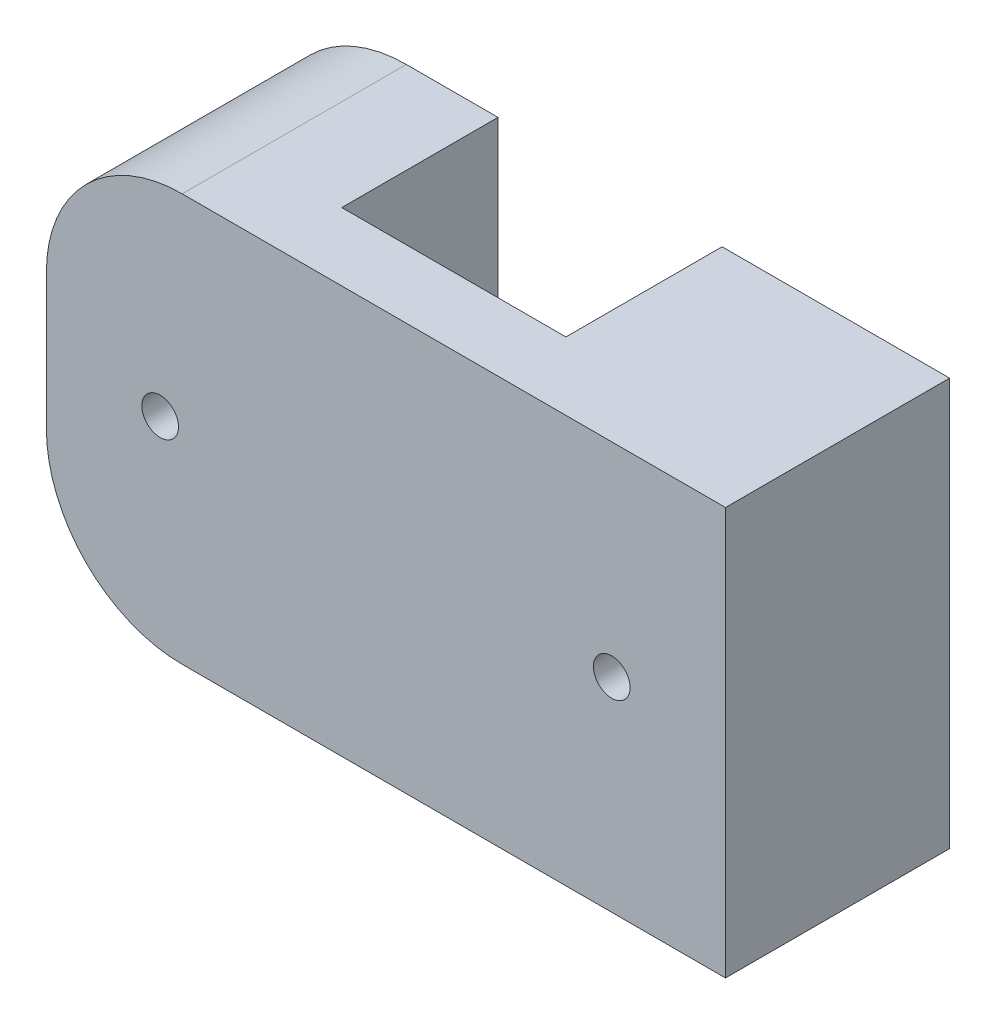
ISO-10303-21;
HEADER;
FILE_DESCRIPTION(('STEP AP214'),'2;1');
FILE_NAME('part.step','',(''),(''),'','','');
FILE_SCHEMA(('AUTOMOTIVE_DESIGN { 1 0 10303 214 1 1 1 1 }'));
ENDSEC;
DATA;
#1=APPLICATION_CONTEXT('core data for automotive mechanical design processes');
#2=APPLICATION_PROTOCOL_DEFINITION('international standard','automotive_design',2000,#1);
#3=PRODUCT_CONTEXT('',#1,'mechanical');
#4=PRODUCT('Part','Part','',(#3));
#5=PRODUCT_RELATED_PRODUCT_CATEGORY('part','',(#4));
#6=PRODUCT_DEFINITION_FORMATION('','',#4);
#7=PRODUCT_DEFINITION_CONTEXT('part definition',#1,'design');
#8=PRODUCT_DEFINITION('design','',#6,#7);
#9=PRODUCT_DEFINITION_SHAPE('','',#8);
#10=(LENGTH_UNIT() NAMED_UNIT(*) SI_UNIT(.MILLI.,.METRE.));
#11=(NAMED_UNIT(*) PLANE_ANGLE_UNIT() SI_UNIT($,.RADIAN.));
#12=(NAMED_UNIT(*) SI_UNIT($,.STERADIAN.) SOLID_ANGLE_UNIT());
#13=UNCERTAINTY_MEASURE_WITH_UNIT(LENGTH_MEASURE(1.E-05),#10,'distance_accuracy_value','');
#14=(GEOMETRIC_REPRESENTATION_CONTEXT(3) GLOBAL_UNCERTAINTY_ASSIGNED_CONTEXT((#13)) GLOBAL_UNIT_ASSIGNED_CONTEXT((#10,
#11,#12)) REPRESENTATION_CONTEXT('',''));
#15=CARTESIAN_POINT('',(0.,0.,0.));
#16=DIRECTION('',(0.,0.,1.));
#17=DIRECTION('',(1.,0.,0.));
#18=AXIS2_PLACEMENT_3D('',#15,#16,#17);
#19=CARTESIAN_POINT('',(16.75,0.,29.9));
#20=DIRECTION('',(1.,0.,0.));
#21=DIRECTION('',(0.,0.,-1.));
#22=AXIS2_PLACEMENT_3D('',#19,#20,#21);
#23=PLANE('',#22);
#24=DIRECTION('',(0.,-1.,0.));
#25=VECTOR('',#24,1.);
#26=CARTESIAN_POINT('',(16.75,0.,18.4));
#27=LINE('',#26,#25);
#28=CARTESIAN_POINT('',(16.75,30.,18.4));
#29=VERTEX_POINT('',#28);
#30=CARTESIAN_POINT('',(16.75,0.,18.4));
#31=VERTEX_POINT('',#30);
#32=EDGE_CURVE('E164',#29,#31,#27,.T.);
#33=ORIENTED_EDGE('',*,*,#32,.F.);
#34=DIRECTION('',(0.,0.,-1.));
#35=VECTOR('',#34,1.);
#36=CARTESIAN_POINT('',(16.75,30.,29.9));
#37=LINE('',#36,#35);
#38=CARTESIAN_POINT('',(16.75,30.,29.9));
#39=VERTEX_POINT('',#38);
#40=EDGE_CURVE('E174',#39,#29,#37,.T.);
#41=ORIENTED_EDGE('',*,*,#40,.F.);
#42=DIRECTION('',(0.,-1.,0.));
#43=VECTOR('',#42,1.);
#44=CARTESIAN_POINT('',(16.75,0.,29.9));
#45=LINE('',#44,#43);
#46=CARTESIAN_POINT('',(16.75,0.,29.9));
#47=VERTEX_POINT('',#46);
#48=EDGE_CURVE('E159',#39,#47,#45,.T.);
#49=ORIENTED_EDGE('',*,*,#48,.T.);
#50=DIRECTION('',(0.,0.,-1.));
#51=VECTOR('',#50,1.);
#52=CARTESIAN_POINT('',(16.75,0.,29.9));
#53=LINE('',#52,#51);
#54=EDGE_CURVE('E142',#47,#31,#53,.T.);
#55=ORIENTED_EDGE('',*,*,#54,.T.);
#56=EDGE_LOOP('',(#33,#41,#49,#55));
#57=FACE_BOUND('',#56,.T.);
#58=ADVANCED_FACE('F38',(#57),#23,.T.);
#59=CARTESIAN_POINT('',(0.,30.,29.9));
#60=DIRECTION('',(0.,-1.,0.));
#61=DIRECTION('',(0.,0.,-1.));
#62=AXIS2_PLACEMENT_3D('',#59,#60,#61);
#63=PLANE('',#62);
#64=DIRECTION('',(-1.,0.,0.));
#65=VECTOR('',#64,1.);
#66=CARTESIAN_POINT('',(0.,30.,18.4));
#67=LINE('',#66,#65);
#68=CARTESIAN_POINT('',(10.,30.,18.4));
#69=VERTEX_POINT('',#68);
#70=EDGE_CURVE('E167',#29,#69,#67,.T.);
#71=ORIENTED_EDGE('',*,*,#70,.T.);
#72=DIRECTION('',(0.,0.,-1.));
#73=VECTOR('',#72,1.);
#74=CARTESIAN_POINT('',(10.,30.,29.9));
#75=LINE('',#74,#73);
#76=CARTESIAN_POINT('',(10.,30.,34.9));
#77=VERTEX_POINT('',#76);
#78=EDGE_CURVE('E61',#69,#77,#75,.F.);
#79=ORIENTED_EDGE('',*,*,#78,.T.);
#80=DIRECTION('',(-1.,0.,0.));
#81=VECTOR('',#80,1.);
#82=CARTESIAN_POINT('',(0.,30.,34.9));
#83=LINE('',#82,#81);
#84=CARTESIAN_POINT('',(50.,30.,34.9));
#85=VERTEX_POINT('',#84);
#86=EDGE_CURVE('E151',#85,#77,#83,.T.);
#87=ORIENTED_EDGE('',*,*,#86,.F.);
#88=DIRECTION('',(0.,0.,-1.));
#89=VECTOR('',#88,1.);
#90=CARTESIAN_POINT('',(50.,30.,34.9));
#91=LINE('',#90,#89);
#92=CARTESIAN_POINT('',(50.,30.,18.4));
#93=VERTEX_POINT('',#92);
#94=EDGE_CURVE('E154',#85,#93,#91,.T.);
#95=ORIENTED_EDGE('',*,*,#94,.T.);
#96=DIRECTION('',(-1.,0.,0.));
#97=VECTOR('',#96,1.);
#98=CARTESIAN_POINT('',(0.,30.,18.4));
#99=LINE('',#98,#97);
#100=CARTESIAN_POINT('',(33.25,30.,18.4));
#101=VERTEX_POINT('',#100);
#102=EDGE_CURVE('E138',#93,#101,#99,.T.);
#103=ORIENTED_EDGE('',*,*,#102,.T.);
#104=DIRECTION('',(0.,0.,-1.));
#105=VECTOR('',#104,1.);
#106=CARTESIAN_POINT('',(33.25,30.,29.9));
#107=LINE('',#106,#105);
#108=CARTESIAN_POINT('',(33.25,30.,29.9));
#109=VERTEX_POINT('',#108);
#110=EDGE_CURVE('E130',#109,#101,#107,.T.);
#111=ORIENTED_EDGE('',*,*,#110,.F.);
#112=DIRECTION('',(-1.,0.,0.));
#113=VECTOR('',#112,1.);
#114=CARTESIAN_POINT('',(0.,30.,29.9));
#115=LINE('',#114,#113);
#116=EDGE_CURVE('E137',#109,#39,#115,.T.);
#117=ORIENTED_EDGE('',*,*,#116,.T.);
#118=ORIENTED_EDGE('',*,*,#40,.T.);
#119=EDGE_LOOP('',(#71,#79,#87,#95,#103,#111,#117,#118));
#120=FACE_BOUND('',#119,.T.);
#121=ADVANCED_FACE('F203',(#120),#63,.F.);
#122=CARTESIAN_POINT('',(0.,0.,29.9));
#123=DIRECTION('',(1.,0.,0.));
#124=DIRECTION('',(0.,0.,-1.));
#125=AXIS2_PLACEMENT_3D('',#122,#123,#124);
#126=PLANE('',#125);
#127=DIRECTION('',(0.,-1.,0.));
#128=VECTOR('',#127,1.);
#129=CARTESIAN_POINT('',(0.,0.,34.9));
#130=LINE('',#129,#128);
#131=CARTESIAN_POINT('',(0.,20.,34.9));
#132=VERTEX_POINT('',#131);
#133=CARTESIAN_POINT('',(0.,10.,34.9));
#134=VERTEX_POINT('',#133);
#135=EDGE_CURVE('E146',#132,#134,#130,.T.);
#136=ORIENTED_EDGE('',*,*,#135,.F.);
#137=DIRECTION('',(0.,0.,-1.));
#138=VECTOR('',#137,1.);
#139=CARTESIAN_POINT('',(0.,20.,29.9));
#140=LINE('',#139,#138);
#141=CARTESIAN_POINT('',(0.,20.,18.4));
#142=VERTEX_POINT('',#141);
#143=EDGE_CURVE('E178',#132,#142,#140,.T.);
#144=ORIENTED_EDGE('',*,*,#143,.T.);
#145=DIRECTION('',(0.,-1.,0.));
#146=VECTOR('',#145,1.);
#147=CARTESIAN_POINT('',(0.,0.,18.4));
#148=LINE('',#147,#146);
#149=CARTESIAN_POINT('',(0.,10.,18.4));
#150=VERTEX_POINT('',#149);
#151=EDGE_CURVE('E169',#142,#150,#148,.T.);
#152=ORIENTED_EDGE('',*,*,#151,.T.);
#153=DIRECTION('',(0.,0.,-1.));
#154=VECTOR('',#153,1.);
#155=CARTESIAN_POINT('',(0.,10.,29.9));
#156=LINE('',#155,#154);
#157=EDGE_CURVE('E176',#150,#134,#156,.F.);
#158=ORIENTED_EDGE('',*,*,#157,.T.);
#159=EDGE_LOOP('',(#136,#144,#152,#158));
#160=FACE_BOUND('',#159,.T.);
#161=ADVANCED_FACE('F193',(#160),#126,.F.);
#162=CARTESIAN_POINT('',(8.375,15.,29.9));
#163=DIRECTION('',(0.,0.,-1.));
#164=DIRECTION('',(-1.,0.,0.));
#165=AXIS2_PLACEMENT_3D('',#162,#163,#164);
#166=CYLINDRICAL_SURFACE('',#165,1.35);
#167=CARTESIAN_POINT('',(8.375,15.,18.4));
#168=DIRECTION('',(0.,0.,1.));
#169=DIRECTION('',(1.,0.,0.));
#170=AXIS2_PLACEMENT_3D('',#167,#168,#169);
#171=CIRCLE('',#170,1.35);
#172=CARTESIAN_POINT('',(9.725,15.,18.4));
#173=VERTEX_POINT('',#172);
#174=EDGE_CURVE('E158',#173,#173,#171,.T.);
#175=ORIENTED_EDGE('',*,*,#174,.F.);
#176=EDGE_LOOP('',(#175));
#177=FACE_BOUND('',#176,.T.);
#178=CARTESIAN_POINT('',(8.375,15.,34.9));
#179=DIRECTION('',(0.,0.,1.));
#180=DIRECTION('',(1.,0.,0.));
#181=AXIS2_PLACEMENT_3D('',#178,#179,#180);
#182=CIRCLE('',#181,1.35);
#183=CARTESIAN_POINT('',(9.725,15.,34.9));
#184=VERTEX_POINT('',#183);
#185=EDGE_CURVE('E144',#184,#184,#182,.T.);
#186=ORIENTED_EDGE('',*,*,#185,.T.);
#187=EDGE_LOOP('',(#186));
#188=FACE_BOUND('',#187,.T.);
#189=ADVANCED_FACE('F223',(#177,#188),#166,.F.);
#190=CARTESIAN_POINT('',(0.,0.,29.9));
#191=DIRECTION('',(0.,1.,0.));
#192=DIRECTION('',(0.,0.,1.));
#193=AXIS2_PLACEMENT_3D('',#190,#191,#192);
#194=PLANE('',#193);
#195=DIRECTION('',(1.,0.,0.));
#196=VECTOR('',#195,1.);
#197=CARTESIAN_POINT('',(0.,0.,34.9));
#198=LINE('',#197,#196);
#199=CARTESIAN_POINT('',(10.,0.,34.9));
#200=VERTEX_POINT('',#199);
#201=CARTESIAN_POINT('',(50.,0.,34.9));
#202=VERTEX_POINT('',#201);
#203=EDGE_CURVE('E196',#200,#202,#198,.T.);
#204=ORIENTED_EDGE('',*,*,#203,.F.);
#205=DIRECTION('',(0.,0.,-1.));
#206=VECTOR('',#205,1.);
#207=CARTESIAN_POINT('',(10.,0.,29.9));
#208=LINE('',#207,#206);
#209=CARTESIAN_POINT('',(10.,0.,18.4));
#210=VERTEX_POINT('',#209);
#211=EDGE_CURVE('E11',#200,#210,#208,.T.);
#212=ORIENTED_EDGE('',*,*,#211,.T.);
#213=DIRECTION('',(1.,0.,0.));
#214=VECTOR('',#213,1.);
#215=CARTESIAN_POINT('',(0.,0.,18.4));
#216=LINE('',#215,#214);
#217=EDGE_CURVE('E161',#210,#31,#216,.T.);
#218=ORIENTED_EDGE('',*,*,#217,.T.);
#219=ORIENTED_EDGE('',*,*,#54,.F.);
#220=DIRECTION('',(1.,0.,0.));
#221=VECTOR('',#220,1.);
#222=CARTESIAN_POINT('',(0.,0.,29.9));
#223=LINE('',#222,#221);
#224=CARTESIAN_POINT('',(33.25,0.,29.9));
#225=VERTEX_POINT('',#224);
#226=EDGE_CURVE('E135',#47,#225,#223,.T.);
#227=ORIENTED_EDGE('',*,*,#226,.T.);
#228=DIRECTION('',(0.,0.,-1.));
#229=VECTOR('',#228,1.);
#230=CARTESIAN_POINT('',(33.25,0.,29.9));
#231=LINE('',#230,#229);
#232=CARTESIAN_POINT('',(33.25,0.,18.4));
#233=VERTEX_POINT('',#232);
#234=EDGE_CURVE('E118',#225,#233,#231,.T.);
#235=ORIENTED_EDGE('',*,*,#234,.T.);
#236=DIRECTION('',(1.,0.,0.));
#237=VECTOR('',#236,1.);
#238=CARTESIAN_POINT('',(0.,0.,18.4));
#239=LINE('',#238,#237);
#240=CARTESIAN_POINT('',(50.,0.,18.4));
#241=VERTEX_POINT('',#240);
#242=EDGE_CURVE('E255',#233,#241,#239,.T.);
#243=ORIENTED_EDGE('',*,*,#242,.T.);
#244=DIRECTION('',(0.,0.,-1.));
#245=VECTOR('',#244,1.);
#246=CARTESIAN_POINT('',(50.,0.,34.9));
#247=LINE('',#246,#245);
#248=EDGE_CURVE('E156',#202,#241,#247,.T.);
#249=ORIENTED_EDGE('',*,*,#248,.F.);
#250=EDGE_LOOP('',(#204,#212,#218,#219,#227,#235,#243,#249));
#251=FACE_BOUND('',#250,.T.);
#252=ADVANCED_FACE('F140',(#251),#194,.F.);
#253=CARTESIAN_POINT('',(0.,0.,18.4));
#254=DIRECTION('',(0.,0.,1.));
#255=DIRECTION('',(1.,0.,0.));
#256=AXIS2_PLACEMENT_3D('',#253,#254,#255);
#257=PLANE('',#256);
#258=ORIENTED_EDGE('',*,*,#174,.T.);
#259=EDGE_LOOP('',(#258));
#260=FACE_BOUND('',#259,.T.);
#261=ORIENTED_EDGE('',*,*,#151,.F.);
#262=CARTESIAN_POINT('',(10.,20.,18.4));
#263=DIRECTION('',(0.,0.,1.));
#264=DIRECTION('',(1.,0.,0.));
#265=AXIS2_PLACEMENT_3D('',#262,#263,#264);
#266=CIRCLE('',#265,10.);
#267=EDGE_CURVE('E183',#142,#69,#266,.F.);
#268=ORIENTED_EDGE('',*,*,#267,.T.);
#269=ORIENTED_EDGE('',*,*,#70,.F.);
#270=ORIENTED_EDGE('',*,*,#32,.T.);
#271=ORIENTED_EDGE('',*,*,#217,.F.);
#272=CARTESIAN_POINT('',(10.,10.,18.4));
#273=DIRECTION('',(0.,0.,1.));
#274=DIRECTION('',(1.,0.,0.));
#275=AXIS2_PLACEMENT_3D('',#272,#273,#274);
#276=CIRCLE('',#275,10.);
#277=EDGE_CURVE('E181',#210,#150,#276,.F.);
#278=ORIENTED_EDGE('',*,*,#277,.T.);
#279=EDGE_LOOP('',(#261,#268,#269,#270,#271,#278));
#280=FACE_BOUND('',#279,.T.);
#281=ADVANCED_FACE('F201',(#260,#280),#257,.F.);
#282=CARTESIAN_POINT('',(0.,0.,29.9));
#283=DIRECTION('',(0.,0.,-1.));
#284=DIRECTION('',(-1.,0.,0.));
#285=AXIS2_PLACEMENT_3D('',#282,#283,#284);
#286=PLANE('',#285);
#287=DIRECTION('',(0.,1.,0.));
#288=VECTOR('',#287,1.);
#289=CARTESIAN_POINT('',(33.25,0.,29.9));
#290=LINE('',#289,#288);
#291=EDGE_CURVE('E121',#225,#109,#290,.T.);
#292=ORIENTED_EDGE('',*,*,#291,.F.);
#293=ORIENTED_EDGE('',*,*,#226,.F.);
#294=ORIENTED_EDGE('',*,*,#48,.F.);
#295=ORIENTED_EDGE('',*,*,#116,.F.);
#296=EDGE_LOOP('',(#292,#293,#294,#295));
#297=FACE_BOUND('',#296,.T.);
#298=ADVANCED_FACE('F133',(#297),#286,.T.);
#299=CARTESIAN_POINT('',(0.,0.,34.9));
#300=DIRECTION('',(0.,0.,-1.));
#301=DIRECTION('',(-1.,0.,0.));
#302=AXIS2_PLACEMENT_3D('',#299,#300,#301);
#303=PLANE('',#302);
#304=ORIENTED_EDGE('',*,*,#86,.T.);
#305=CARTESIAN_POINT('',(10.,20.,34.9));
#306=DIRECTION('',(0.,0.,-1.));
#307=DIRECTION('',(-1.,0.,0.));
#308=AXIS2_PLACEMENT_3D('',#305,#306,#307);
#309=CIRCLE('',#308,10.);
#310=EDGE_CURVE('E46',#77,#132,#309,.F.);
#311=ORIENTED_EDGE('',*,*,#310,.T.);
#312=ORIENTED_EDGE('',*,*,#135,.T.);
#313=CARTESIAN_POINT('',(10.,10.,34.9));
#314=DIRECTION('',(0.,0.,-1.));
#315=DIRECTION('',(-1.,0.,0.));
#316=AXIS2_PLACEMENT_3D('',#313,#314,#315);
#317=CIRCLE('',#316,10.);
#318=EDGE_CURVE('E53',#134,#200,#317,.F.);
#319=ORIENTED_EDGE('',*,*,#318,.T.);
#320=ORIENTED_EDGE('',*,*,#203,.T.);
#321=DIRECTION('',(0.,1.,0.));
#322=VECTOR('',#321,1.);
#323=CARTESIAN_POINT('',(50.,0.,34.9));
#324=LINE('',#323,#322);
#325=EDGE_CURVE('E244',#202,#85,#324,.T.);
#326=ORIENTED_EDGE('',*,*,#325,.T.);
#327=EDGE_LOOP('',(#304,#311,#312,#319,#320,#326));
#328=FACE_BOUND('',#327,.T.);
#329=ORIENTED_EDGE('',*,*,#185,.F.);
#330=EDGE_LOOP('',(#329));
#331=FACE_BOUND('',#330,.T.);
#332=CARTESIAN_POINT('',(41.625,15.,34.9));
#333=DIRECTION('',(0.,0.,1.));
#334=DIRECTION('',(1.,0.,0.));
#335=AXIS2_PLACEMENT_3D('',#332,#333,#334);
#336=CIRCLE('',#335,1.35);
#337=CARTESIAN_POINT('',(42.975,15.,34.9));
#338=VERTEX_POINT('',#337);
#339=EDGE_CURVE('E129',#338,#338,#336,.T.);
#340=ORIENTED_EDGE('',*,*,#339,.F.);
#341=EDGE_LOOP('',(#340));
#342=FACE_BOUND('',#341,.T.);
#343=ADVANCED_FACE('F188',(#328,#331,#342),#303,.F.);
#344=CARTESIAN_POINT('',(50.,0.,34.9));
#345=DIRECTION('',(-1.,0.,0.));
#346=DIRECTION('',(0.,0.,1.));
#347=AXIS2_PLACEMENT_3D('',#344,#345,#346);
#348=PLANE('',#347);
#349=ORIENTED_EDGE('',*,*,#248,.T.);
#350=DIRECTION('',(0.,1.,0.));
#351=VECTOR('',#350,1.);
#352=CARTESIAN_POINT('',(50.,0.,18.4));
#353=LINE('',#352,#351);
#354=EDGE_CURVE('E250',#241,#93,#353,.T.);
#355=ORIENTED_EDGE('',*,*,#354,.T.);
#356=ORIENTED_EDGE('',*,*,#94,.F.);
#357=ORIENTED_EDGE('',*,*,#325,.F.);
#358=EDGE_LOOP('',(#349,#355,#356,#357));
#359=FACE_BOUND('',#358,.T.);
#360=ADVANCED_FACE('F236',(#359),#348,.F.);
#361=CARTESIAN_POINT('',(41.625,15.,34.9));
#362=DIRECTION('',(0.,0.,-1.));
#363=DIRECTION('',(-1.,0.,0.));
#364=AXIS2_PLACEMENT_3D('',#361,#362,#363);
#365=CYLINDRICAL_SURFACE('',#364,1.35);
#366=ORIENTED_EDGE('',*,*,#339,.T.);
#367=EDGE_LOOP('',(#366));
#368=FACE_BOUND('',#367,.T.);
#369=CARTESIAN_POINT('',(41.625,15.,18.4));
#370=DIRECTION('',(0.,0.,1.));
#371=DIRECTION('',(1.,0.,0.));
#372=AXIS2_PLACEMENT_3D('',#369,#370,#371);
#373=CIRCLE('',#372,1.35);
#374=CARTESIAN_POINT('',(42.975,15.,18.4));
#375=VERTEX_POINT('',#374);
#376=EDGE_CURVE('E260',#375,#375,#373,.T.);
#377=ORIENTED_EDGE('',*,*,#376,.F.);
#378=EDGE_LOOP('',(#377));
#379=FACE_BOUND('',#378,.T.);
#380=ADVANCED_FACE('F265',(#368,#379),#365,.F.);
#381=CARTESIAN_POINT('',(33.25,0.,29.9));
#382=DIRECTION('',(-1.,0.,0.));
#383=DIRECTION('',(0.,0.,1.));
#384=AXIS2_PLACEMENT_3D('',#381,#382,#383);
#385=PLANE('',#384);
#386=DIRECTION('',(0.,1.,0.));
#387=VECTOR('',#386,1.);
#388=CARTESIAN_POINT('',(33.25,0.,18.4));
#389=LINE('',#388,#387);
#390=EDGE_CURVE('E124',#233,#101,#389,.T.);
#391=ORIENTED_EDGE('',*,*,#390,.F.);
#392=ORIENTED_EDGE('',*,*,#234,.F.);
#393=ORIENTED_EDGE('',*,*,#291,.T.);
#394=ORIENTED_EDGE('',*,*,#110,.T.);
#395=EDGE_LOOP('',(#391,#392,#393,#394));
#396=FACE_BOUND('',#395,.T.);
#397=ADVANCED_FACE('F120',(#396),#385,.T.);
#398=CARTESIAN_POINT('',(0.,0.,18.4));
#399=DIRECTION('',(0.,0.,1.));
#400=DIRECTION('',(1.,0.,0.));
#401=AXIS2_PLACEMENT_3D('',#398,#399,#400);
#402=PLANE('',#401);
#403=ORIENTED_EDGE('',*,*,#376,.T.);
#404=EDGE_LOOP('',(#403));
#405=FACE_BOUND('',#404,.T.);
#406=ORIENTED_EDGE('',*,*,#390,.T.);
#407=ORIENTED_EDGE('',*,*,#102,.F.);
#408=ORIENTED_EDGE('',*,*,#354,.F.);
#409=ORIENTED_EDGE('',*,*,#242,.F.);
#410=EDGE_LOOP('',(#406,#407,#408,#409));
#411=FACE_BOUND('',#410,.T.);
#412=ADVANCED_FACE('F214',(#405,#411),#402,.F.);
#413=CARTESIAN_POINT('',(10.,20.,29.9));
#414=DIRECTION('',(0.,0.,-1.));
#415=DIRECTION('',(-1.,0.,0.));
#416=AXIS2_PLACEMENT_3D('',#413,#414,#415);
#417=CYLINDRICAL_SURFACE('',#416,10.);
#418=ORIENTED_EDGE('',*,*,#310,.F.);
#419=ORIENTED_EDGE('',*,*,#78,.F.);
#420=ORIENTED_EDGE('',*,*,#267,.F.);
#421=ORIENTED_EDGE('',*,*,#143,.F.);
#422=EDGE_LOOP('',(#418,#419,#420,#421));
#423=FACE_BOUND('',#422,.T.);
#424=ADVANCED_FACE('F198',(#423),#417,.T.);
#425=CARTESIAN_POINT('',(10.,10.,29.9));
#426=DIRECTION('',(0.,0.,-1.));
#427=DIRECTION('',(-1.,0.,0.));
#428=AXIS2_PLACEMENT_3D('',#425,#426,#427);
#429=CYLINDRICAL_SURFACE('',#428,10.);
#430=ORIENTED_EDGE('',*,*,#318,.F.);
#431=ORIENTED_EDGE('',*,*,#157,.F.);
#432=ORIENTED_EDGE('',*,*,#277,.F.);
#433=ORIENTED_EDGE('',*,*,#211,.F.);
#434=EDGE_LOOP('',(#430,#431,#432,#433));
#435=FACE_BOUND('',#434,.T.);
#436=ADVANCED_FACE('F40',(#435),#429,.T.);
#437=CLOSED_SHELL('',(#58,#121,#161,#189,#252,#281,#298,#343,#360,#380,#397,#412,#424,#436));
#438=MANIFOLD_SOLID_BREP('B2',#437);
#439=ADVANCED_BREP_SHAPE_REPRESENTATION('',(#18,#438),#14);
#440=SHAPE_DEFINITION_REPRESENTATION(#9,#439);
ENDSEC;
END-ISO-10303-21;
